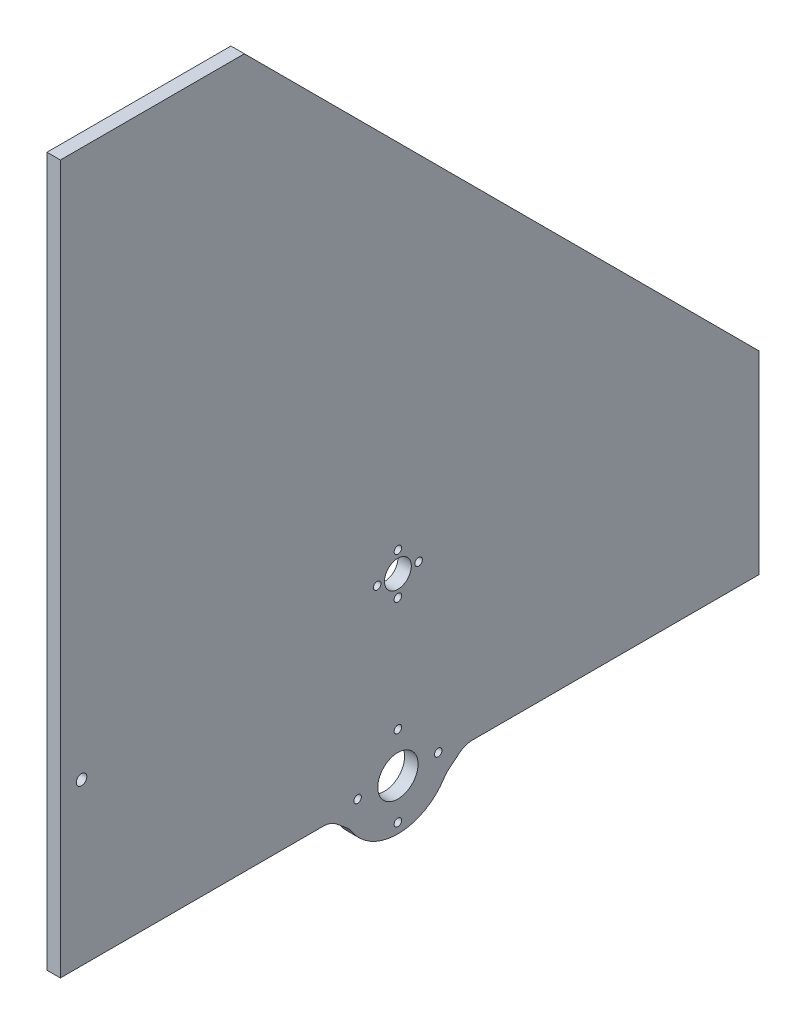
ISO-10303-21;
HEADER;
FILE_DESCRIPTION(('STEP AP214'),'2;1');
FILE_NAME('part.step','',(''),(''),'','','');
FILE_SCHEMA(('AUTOMOTIVE_DESIGN { 1 0 10303 214 1 1 1 1 }'));
ENDSEC;
DATA;
#1=APPLICATION_CONTEXT('core data for automotive mechanical design processes');
#2=APPLICATION_PROTOCOL_DEFINITION('international standard','automotive_design',2000,#1);
#3=PRODUCT_CONTEXT('',#1,'mechanical');
#4=PRODUCT('Part','Part','',(#3));
#5=PRODUCT_RELATED_PRODUCT_CATEGORY('part','',(#4));
#6=PRODUCT_DEFINITION_FORMATION('','',#4);
#7=PRODUCT_DEFINITION_CONTEXT('part definition',#1,'design');
#8=PRODUCT_DEFINITION('design','',#6,#7);
#9=PRODUCT_DEFINITION_SHAPE('','',#8);
#10=(LENGTH_UNIT() NAMED_UNIT(*) SI_UNIT(.MILLI.,.METRE.));
#11=(NAMED_UNIT(*) PLANE_ANGLE_UNIT() SI_UNIT($,.RADIAN.));
#12=(NAMED_UNIT(*) SI_UNIT($,.STERADIAN.) SOLID_ANGLE_UNIT());
#13=UNCERTAINTY_MEASURE_WITH_UNIT(LENGTH_MEASURE(1.E-05),#10,'distance_accuracy_value','');
#14=(GEOMETRIC_REPRESENTATION_CONTEXT(3) GLOBAL_UNCERTAINTY_ASSIGNED_CONTEXT((#13)) GLOBAL_UNIT_ASSIGNED_CONTEXT((#10,
#11,#12)) REPRESENTATION_CONTEXT('',''));
#15=CARTESIAN_POINT('',(0.,0.,0.));
#16=DIRECTION('',(0.,0.,1.));
#17=DIRECTION('',(1.,0.,0.));
#18=AXIS2_PLACEMENT_3D('',#15,#16,#17);
#19=CARTESIAN_POINT('',(6.35,0.,0.));
#20=DIRECTION('',(-1.,0.,0.));
#21=DIRECTION('',(0.,0.,1.));
#22=AXIS2_PLACEMENT_3D('',#19,#20,#21);
#23=PLANE('',#22);
#24=CARTESIAN_POINT('',(6.35,97.0026,-10.));
#25=DIRECTION('',(1.,0.,0.));
#26=DIRECTION('',(0.,0.,-1.));
#27=AXIS2_PLACEMENT_3D('',#24,#25,#26);
#28=CIRCLE('',#27,2.5);
#29=CARTESIAN_POINT('',(6.35,97.0026,-12.5));
#30=VERTEX_POINT('',#29);
#31=EDGE_CURVE('E486',#30,#30,#28,.T.);
#32=ORIENTED_EDGE('',*,*,#31,.F.);
#33=EDGE_LOOP('',(#32));
#34=FACE_BOUND('',#33,.T.);
#35=CARTESIAN_POINT('',(6.35,116.2812,-159.512));
#36=DIRECTION('',(1.,0.,0.));
#37=DIRECTION('',(0.,0.,-1.));
#38=AXIS2_PLACEMENT_3D('',#35,#36,#37);
#39=CIRCLE('',#38,1.778);
#40=CARTESIAN_POINT('',(6.35,116.2812,-161.29));
#41=VERTEX_POINT('',#40);
#42=EDGE_CURVE('E463',#41,#41,#39,.T.);
#43=ORIENTED_EDGE('',*,*,#42,.F.);
#44=EDGE_LOOP('',(#43));
#45=FACE_BOUND('',#44,.T.);
#46=CARTESIAN_POINT('',(6.35,106.5022,-149.733));
#47=DIRECTION('',(1.,0.,0.));
#48=DIRECTION('',(0.,0.,-1.));
#49=AXIS2_PLACEMENT_3D('',#46,#47,#48);
#50=CIRCLE('',#49,1.778);
#51=CARTESIAN_POINT('',(6.35,106.5022,-151.511));
#52=VERTEX_POINT('',#51);
#53=EDGE_CURVE('E454',#52,#52,#50,.T.);
#54=ORIENTED_EDGE('',*,*,#53,.F.);
#55=EDGE_LOOP('',(#54));
#56=FACE_BOUND('',#55,.T.);
#57=CARTESIAN_POINT('',(6.35,106.5022,-169.291));
#58=DIRECTION('',(1.,0.,0.));
#59=DIRECTION('',(0.,0.,-1.));
#60=AXIS2_PLACEMENT_3D('',#57,#58,#59);
#61=CIRCLE('',#60,1.778);
#62=CARTESIAN_POINT('',(6.35,106.5022,-171.069));
#63=VERTEX_POINT('',#62);
#64=EDGE_CURVE('E479',#63,#63,#61,.T.);
#65=ORIENTED_EDGE('',*,*,#64,.F.);
#66=EDGE_LOOP('',(#65));
#67=FACE_BOUND('',#66,.T.);
#68=CARTESIAN_POINT('',(6.35,96.7232,-159.512));
#69=DIRECTION('',(1.,0.,0.));
#70=DIRECTION('',(0.,0.,-1.));
#71=AXIS2_PLACEMENT_3D('',#68,#69,#70);
#72=CIRCLE('',#71,1.778);
#73=CARTESIAN_POINT('',(6.35,96.7232,-161.29));
#74=VERTEX_POINT('',#73);
#75=EDGE_CURVE('E470',#74,#74,#72,.T.);
#76=ORIENTED_EDGE('',*,*,#75,.F.);
#77=EDGE_LOOP('',(#76));
#78=FACE_BOUND('',#77,.T.);
#79=CARTESIAN_POINT('',(6.35,106.5022,-159.512));
#80=DIRECTION('',(1.,0.,0.));
#81=DIRECTION('',(0.,0.,-1.));
#82=AXIS2_PLACEMENT_3D('',#79,#80,#81);
#83=CIRCLE('',#82,6.34999999999999);
#84=CARTESIAN_POINT('',(6.35,106.5022,-165.862));
#85=VERTEX_POINT('',#84);
#86=EDGE_CURVE('E446',#85,#85,#83,.T.);
#87=ORIENTED_EDGE('',*,*,#86,.F.);
#88=EDGE_LOOP('',(#87));
#89=FACE_BOUND('',#88,.T.);
#90=CARTESIAN_POINT('',(6.35,23.8252,-140.462));
#91=DIRECTION('',(1.,0.,0.));
#92=DIRECTION('',(0.,0.,-1.));
#93=AXIS2_PLACEMENT_3D('',#90,#91,#92);
#94=CIRCLE('',#93,1.77800000000001);
#95=CARTESIAN_POINT('',(6.35,23.8252,-142.24));
#96=VERTEX_POINT('',#95);
#97=EDGE_CURVE('E430',#96,#96,#94,.T.);
#98=ORIENTED_EDGE('',*,*,#97,.F.);
#99=EDGE_LOOP('',(#98));
#100=FACE_BOUND('',#99,.T.);
#101=CARTESIAN_POINT('',(6.35,42.8752,-159.512));
#102=DIRECTION('',(1.,0.,0.));
#103=DIRECTION('',(0.,0.,-1.));
#104=AXIS2_PLACEMENT_3D('',#101,#102,#103);
#105=CIRCLE('',#104,1.77800000000001);
#106=CARTESIAN_POINT('',(6.35,42.8752,-161.29));
#107=VERTEX_POINT('',#106);
#108=EDGE_CURVE('E439',#107,#107,#105,.T.);
#109=ORIENTED_EDGE('',*,*,#108,.F.);
#110=EDGE_LOOP('',(#109));
#111=FACE_BOUND('',#110,.T.);
#112=CARTESIAN_POINT('',(6.35,23.8252,-159.512));
#113=DIRECTION('',(1.,0.,0.));
#114=DIRECTION('',(0.,0.,-1.));
#115=AXIS2_PLACEMENT_3D('',#112,#113,#114);
#116=CIRCLE('',#115,9.52500000000002);
#117=CARTESIAN_POINT('',(6.35,23.8252,-169.037));
#118=VERTEX_POINT('',#117);
#119=EDGE_CURVE('E407',#118,#118,#116,.T.);
#120=ORIENTED_EDGE('',*,*,#119,.F.);
#121=EDGE_LOOP('',(#120));
#122=FACE_BOUND('',#121,.T.);
#123=CARTESIAN_POINT('',(6.35,23.8252,-178.562));
#124=DIRECTION('',(1.,0.,0.));
#125=DIRECTION('',(0.,0.,-1.));
#126=AXIS2_PLACEMENT_3D('',#123,#124,#125);
#127=CIRCLE('',#126,1.77800000000001);
#128=CARTESIAN_POINT('',(6.35,23.8252,-180.34));
#129=VERTEX_POINT('',#128);
#130=EDGE_CURVE('E414',#129,#129,#127,.T.);
#131=ORIENTED_EDGE('',*,*,#130,.F.);
#132=EDGE_LOOP('',(#131));
#133=FACE_BOUND('',#132,.T.);
#134=CARTESIAN_POINT('',(6.35,4.77520000000007,-159.512));
#135=DIRECTION('',(1.,0.,0.));
#136=DIRECTION('',(0.,0.,-1.));
#137=AXIS2_PLACEMENT_3D('',#134,#135,#136);
#138=CIRCLE('',#137,1.77800000000001);
#139=CARTESIAN_POINT('',(6.35,4.77520000000007,-161.29));
#140=VERTEX_POINT('',#139);
#141=EDGE_CURVE('E423',#140,#140,#138,.T.);
#142=ORIENTED_EDGE('',*,*,#141,.F.);
#143=EDGE_LOOP('',(#142));
#144=FACE_BOUND('',#143,.T.);
#145=DIRECTION('',(0.,0.,-1.));
#146=VECTOR('',#145,1.);
#147=CARTESIAN_POINT('',(6.35,20.8026000000001,0.));
#148=LINE('',#147,#146);
#149=CARTESIAN_POINT('',(6.35,20.8026000000001,0.));
#150=VERTEX_POINT('',#149);
#151=CARTESIAN_POINT('',(6.35,20.8026,-124.18961565833));
#152=VERTEX_POINT('',#151);
#153=EDGE_CURVE('E313',#150,#152,#148,.T.);
#154=ORIENTED_EDGE('',*,*,#153,.T.);
#155=CARTESIAN_POINT('',(6.35,10.8026,-124.18961565833));
#156=DIRECTION('',(-1.,0.,0.));
#157=DIRECTION('',(0.,0.,1.));
#158=AXIS2_PLACEMENT_3D('',#155,#156,#157);
#159=CIRCLE('',#158,10.);
#160=CARTESIAN_POINT('',(6.35,18.5390682624872,-130.525786333394));
#161=VERTEX_POINT('',#160);
#162=EDGE_CURVE('E110',#152,#161,#159,.T.);
#163=ORIENTED_EDGE('',*,*,#162,.T.);
#164=DIRECTION('',(0.,-0.633617067506309,-0.773646826248713));
#165=VECTOR('',#164,1.);
#166=CARTESIAN_POINT('',(6.35,75.0793742249906,-61.4900382352941));
#167=LINE('',#166,#165);
#168=CARTESIAN_POINT('',(6.35,14.4799414737817,-135.481982620502));
#169=VERTEX_POINT('',#168);
#170=EDGE_CURVE('E258',#161,#169,#167,.T.);
#171=ORIENTED_EDGE('',*,*,#170,.T.);
#172=CARTESIAN_POINT('',(6.35,6.74347321129459,-129.145811945439));
#173=DIRECTION('',(-1.,0.,0.));
#174=DIRECTION('',(0.,0.,1.));
#175=AXIS2_PLACEMENT_3D('',#172,#173,#174);
#176=CIRCLE('',#175,10.);
#177=CARTESIAN_POINT('',(6.35,12.0805921788521,-137.602475656746));
#178=VERTEX_POINT('',#177);
#179=EDGE_CURVE('E305',#169,#178,#176,.T.);
#180=ORIENTED_EDGE('',*,*,#179,.T.);
#181=CARTESIAN_POINT('',(6.35,25.908,-159.512));
#182=DIRECTION('',(1.,0.,0.));
#183=DIRECTION('',(0.,0.,-1.));
#184=AXIS2_PLACEMENT_3D('',#181,#182,#183);
#185=CIRCLE('',#184,25.908);
#186=CARTESIAN_POINT('',(6.35,12.0805921788522,-181.421524343254));
#187=VERTEX_POINT('',#186);
#188=EDGE_CURVE('E217',#178,#187,#185,.T.);
#189=ORIENTED_EDGE('',*,*,#188,.T.);
#190=CARTESIAN_POINT('',(6.35,6.74347321129479,-189.878188054562));
#191=DIRECTION('',(-1.,0.,0.));
#192=DIRECTION('',(0.,0.,1.));
#193=AXIS2_PLACEMENT_3D('',#190,#191,#192);
#194=CIRCLE('',#193,10.);
#195=CARTESIAN_POINT('',(6.35,14.4799414737819,-183.542017379499));
#196=VERTEX_POINT('',#195);
#197=EDGE_CURVE('E296',#187,#196,#194,.T.);
#198=ORIENTED_EDGE('',*,*,#197,.T.);
#199=DIRECTION('',(0.,0.633617067506306,-0.773646826248715));
#200=VECTOR('',#199,1.);
#201=CARTESIAN_POINT('',(6.35,-81.304861308323,-66.5887147058818));
#202=LINE('',#201,#200);
#203=CARTESIAN_POINT('',(6.35,18.5390682624872,-188.498213666606));
#204=VERTEX_POINT('',#203);
#205=EDGE_CURVE('E250',#196,#204,#202,.T.);
#206=ORIENTED_EDGE('',*,*,#205,.T.);
#207=CARTESIAN_POINT('',(6.35,10.8026,-194.834384341669));
#208=DIRECTION('',(-1.,0.,0.));
#209=DIRECTION('',(0.,0.,1.));
#210=AXIS2_PLACEMENT_3D('',#207,#208,#209);
#211=CIRCLE('',#210,10.);
#212=CARTESIAN_POINT('',(6.35,20.8026,-194.834384341669));
#213=VERTEX_POINT('',#212);
#214=EDGE_CURVE('E293',#204,#213,#211,.T.);
#215=ORIENTED_EDGE('',*,*,#214,.T.);
#216=DIRECTION('',(0.,0.,-1.));
#217=VECTOR('',#216,1.);
#218=CARTESIAN_POINT('',(6.35,20.8026,0.));
#219=LINE('',#218,#217);
#220=CARTESIAN_POINT('',(6.35,20.8026,-330.2));
#221=VERTEX_POINT('',#220);
#222=EDGE_CURVE('E208',#213,#221,#219,.T.);
#223=ORIENTED_EDGE('',*,*,#222,.T.);
#224=DIRECTION('',(0.,1.,0.));
#225=VECTOR('',#224,1.);
#226=CARTESIAN_POINT('',(6.35,0.,-330.2));
#227=LINE('',#226,#225);
#228=CARTESIAN_POINT('',(6.35,112.361360549045,-330.2));
#229=VERTEX_POINT('',#228);
#230=EDGE_CURVE('E215',#221,#229,#227,.T.);
#231=ORIENTED_EDGE('',*,*,#230,.T.);
#232=DIRECTION('',(0.,0.707106781186546,0.707106781186549));
#233=VECTOR('',#232,1.);
#234=CARTESIAN_POINT('',(6.35,112.361360549045,-330.2));
#235=LINE('',#234,#233);
#236=CARTESIAN_POINT('',(6.35,355.6,-86.9613605490437));
#237=VERTEX_POINT('',#236);
#238=EDGE_CURVE('E341',#229,#237,#235,.T.);
#239=ORIENTED_EDGE('',*,*,#238,.T.);
#240=DIRECTION('',(0.,0.,1.));
#241=VECTOR('',#240,1.);
#242=CARTESIAN_POINT('',(6.35,355.6,0.));
#243=LINE('',#242,#241);
#244=CARTESIAN_POINT('',(6.35,355.6,0.));
#245=VERTEX_POINT('',#244);
#246=EDGE_CURVE('E243',#237,#245,#243,.T.);
#247=ORIENTED_EDGE('',*,*,#246,.T.);
#248=DIRECTION('',(0.,-1.,0.));
#249=VECTOR('',#248,1.);
#250=CARTESIAN_POINT('',(6.35,0.,0.));
#251=LINE('',#250,#249);
#252=EDGE_CURVE('E237',#245,#150,#251,.T.);
#253=ORIENTED_EDGE('',*,*,#252,.T.);
#254=EDGE_LOOP('',(#154,#163,#171,#180,#189,#198,#206,#215,#223,#231,#239,#247,#253));
#255=FACE_BOUND('',#254,.T.);
#256=ADVANCED_FACE('F101',(#34,#45,#56,#67,#78,#89,#100,#111,#122,#133,#144,#255),#23,.F.);
#257=CARTESIAN_POINT('',(0.,0.,0.));
#258=DIRECTION('',(-1.,0.,0.));
#259=DIRECTION('',(0.,0.,1.));
#260=AXIS2_PLACEMENT_3D('',#257,#258,#259);
#261=PLANE('',#260);
#262=CARTESIAN_POINT('',(0.,97.0026,-10.));
#263=DIRECTION('',(1.,0.,0.));
#264=DIRECTION('',(0.,0.,-1.));
#265=AXIS2_PLACEMENT_3D('',#262,#263,#264);
#266=CIRCLE('',#265,2.5);
#267=CARTESIAN_POINT('',(0.,97.0026,-12.5));
#268=VERTEX_POINT('',#267);
#269=EDGE_CURVE('E475',#268,#268,#266,.T.);
#270=ORIENTED_EDGE('',*,*,#269,.T.);
#271=EDGE_LOOP('',(#270));
#272=FACE_BOUND('',#271,.T.);
#273=CARTESIAN_POINT('',(0.,116.2812,-159.512));
#274=DIRECTION('',(1.,0.,0.));
#275=DIRECTION('',(0.,0.,-1.));
#276=AXIS2_PLACEMENT_3D('',#273,#274,#275);
#277=CIRCLE('',#276,1.778);
#278=CARTESIAN_POINT('',(0.,116.2812,-161.29));
#279=VERTEX_POINT('',#278);
#280=EDGE_CURVE('E450',#279,#279,#277,.T.);
#281=ORIENTED_EDGE('',*,*,#280,.T.);
#282=EDGE_LOOP('',(#281));
#283=FACE_BOUND('',#282,.T.);
#284=CARTESIAN_POINT('',(0.,106.5022,-149.733));
#285=DIRECTION('',(1.,0.,0.));
#286=DIRECTION('',(0.,0.,-1.));
#287=AXIS2_PLACEMENT_3D('',#284,#285,#286);
#288=CIRCLE('',#287,1.778);
#289=CARTESIAN_POINT('',(0.,106.5022,-151.511));
#290=VERTEX_POINT('',#289);
#291=EDGE_CURVE('E458',#290,#290,#288,.T.);
#292=ORIENTED_EDGE('',*,*,#291,.T.);
#293=EDGE_LOOP('',(#292));
#294=FACE_BOUND('',#293,.T.);
#295=CARTESIAN_POINT('',(0.,106.5022,-169.291));
#296=DIRECTION('',(1.,0.,0.));
#297=DIRECTION('',(0.,0.,-1.));
#298=AXIS2_PLACEMENT_3D('',#295,#296,#297);
#299=CIRCLE('',#298,1.778);
#300=CARTESIAN_POINT('',(0.,106.5022,-171.069));
#301=VERTEX_POINT('',#300);
#302=EDGE_CURVE('E459',#301,#301,#299,.T.);
#303=ORIENTED_EDGE('',*,*,#302,.T.);
#304=EDGE_LOOP('',(#303));
#305=FACE_BOUND('',#304,.T.);
#306=CARTESIAN_POINT('',(0.,96.7232,-159.512));
#307=DIRECTION('',(1.,0.,0.));
#308=DIRECTION('',(0.,0.,-1.));
#309=AXIS2_PLACEMENT_3D('',#306,#307,#308);
#310=CIRCLE('',#309,1.778);
#311=CARTESIAN_POINT('',(0.,96.7232,-161.29));
#312=VERTEX_POINT('',#311);
#313=EDGE_CURVE('E474',#312,#312,#310,.T.);
#314=ORIENTED_EDGE('',*,*,#313,.T.);
#315=EDGE_LOOP('',(#314));
#316=FACE_BOUND('',#315,.T.);
#317=CARTESIAN_POINT('',(0.,106.5022,-159.512));
#318=DIRECTION('',(1.,0.,0.));
#319=DIRECTION('',(0.,0.,-1.));
#320=AXIS2_PLACEMENT_3D('',#317,#318,#319);
#321=CIRCLE('',#320,6.34999999999999);
#322=CARTESIAN_POINT('',(0.,106.5022,-165.862));
#323=VERTEX_POINT('',#322);
#324=EDGE_CURVE('E435',#323,#323,#321,.T.);
#325=ORIENTED_EDGE('',*,*,#324,.T.);
#326=EDGE_LOOP('',(#325));
#327=FACE_BOUND('',#326,.T.);
#328=CARTESIAN_POINT('',(0.,23.8252,-140.462));
#329=DIRECTION('',(1.,0.,0.));
#330=DIRECTION('',(0.,0.,-1.));
#331=AXIS2_PLACEMENT_3D('',#328,#329,#330);
#332=CIRCLE('',#331,1.77800000000001);
#333=CARTESIAN_POINT('',(0.,23.8252,-142.24));
#334=VERTEX_POINT('',#333);
#335=EDGE_CURVE('E434',#334,#334,#332,.T.);
#336=ORIENTED_EDGE('',*,*,#335,.T.);
#337=EDGE_LOOP('',(#336));
#338=FACE_BOUND('',#337,.T.);
#339=CARTESIAN_POINT('',(0.,42.8752,-159.512));
#340=DIRECTION('',(1.,0.,0.));
#341=DIRECTION('',(0.,0.,-1.));
#342=AXIS2_PLACEMENT_3D('',#339,#340,#341);
#343=CIRCLE('',#342,1.77800000000001);
#344=CARTESIAN_POINT('',(0.,42.8752,-161.29));
#345=VERTEX_POINT('',#344);
#346=EDGE_CURVE('E419',#345,#345,#343,.T.);
#347=ORIENTED_EDGE('',*,*,#346,.T.);
#348=EDGE_LOOP('',(#347));
#349=FACE_BOUND('',#348,.T.);
#350=CARTESIAN_POINT('',(0.,23.8252,-159.512));
#351=DIRECTION('',(1.,0.,0.));
#352=DIRECTION('',(0.,0.,-1.));
#353=AXIS2_PLACEMENT_3D('',#350,#351,#352);
#354=CIRCLE('',#353,9.52500000000002);
#355=CARTESIAN_POINT('',(0.,23.8252,-169.037));
#356=VERTEX_POINT('',#355);
#357=EDGE_CURVE('E403',#356,#356,#354,.T.);
#358=ORIENTED_EDGE('',*,*,#357,.T.);
#359=EDGE_LOOP('',(#358));
#360=FACE_BOUND('',#359,.T.);
#361=CARTESIAN_POINT('',(0.,4.77520000000007,-159.512));
#362=DIRECTION('',(1.,0.,0.));
#363=DIRECTION('',(0.,0.,-1.));
#364=AXIS2_PLACEMENT_3D('',#361,#362,#363);
#365=CIRCLE('',#364,1.77800000000001);
#366=CARTESIAN_POINT('',(0.,4.77520000000007,-161.29));
#367=VERTEX_POINT('',#366);
#368=EDGE_CURVE('E412',#367,#367,#365,.T.);
#369=ORIENTED_EDGE('',*,*,#368,.T.);
#370=EDGE_LOOP('',(#369));
#371=FACE_BOUND('',#370,.T.);
#372=CARTESIAN_POINT('',(0.,23.8252,-178.562));
#373=DIRECTION('',(1.,0.,0.));
#374=DIRECTION('',(0.,0.,-1.));
#375=AXIS2_PLACEMENT_3D('',#372,#373,#374);
#376=CIRCLE('',#375,1.77800000000001);
#377=CARTESIAN_POINT('',(0.,23.8252,-180.34));
#378=VERTEX_POINT('',#377);
#379=EDGE_CURVE('E418',#378,#378,#376,.T.);
#380=ORIENTED_EDGE('',*,*,#379,.T.);
#381=EDGE_LOOP('',(#380));
#382=FACE_BOUND('',#381,.T.);
#383=DIRECTION('',(0.,0.,-1.));
#384=VECTOR('',#383,1.);
#385=CARTESIAN_POINT('',(0.,20.8026,0.));
#386=LINE('',#385,#384);
#387=CARTESIAN_POINT('',(0.,20.8026,-194.834384341669));
#388=VERTEX_POINT('',#387);
#389=CARTESIAN_POINT('',(0.,20.8026,-330.2));
#390=VERTEX_POINT('',#389);
#391=EDGE_CURVE('E198',#388,#390,#386,.T.);
#392=ORIENTED_EDGE('',*,*,#391,.F.);
#393=CARTESIAN_POINT('',(0.,10.8026,-194.834384341669));
#394=DIRECTION('',(-1.,0.,0.));
#395=DIRECTION('',(0.,0.,1.));
#396=AXIS2_PLACEMENT_3D('',#393,#394,#395);
#397=CIRCLE('',#396,10.);
#398=CARTESIAN_POINT('',(0.,18.5390682624872,-188.498213666606));
#399=VERTEX_POINT('',#398);
#400=EDGE_CURVE('E290',#388,#399,#397,.F.);
#401=ORIENTED_EDGE('',*,*,#400,.T.);
#402=DIRECTION('',(0.,-0.633617067506306,0.773646826248715));
#403=VECTOR('',#402,1.);
#404=CARTESIAN_POINT('',(0.,13.3659537180332,-182.181837649639));
#405=LINE('',#404,#403);
#406=CARTESIAN_POINT('',(0.,14.4799414737819,-183.542017379499));
#407=VERTEX_POINT('',#406);
#408=EDGE_CURVE('E254',#399,#407,#405,.T.);
#409=ORIENTED_EDGE('',*,*,#408,.T.);
#410=CARTESIAN_POINT('',(0.,6.74347321129479,-189.878188054562));
#411=DIRECTION('',(-1.,0.,0.));
#412=DIRECTION('',(0.,0.,1.));
#413=AXIS2_PLACEMENT_3D('',#410,#411,#412);
#414=CIRCLE('',#413,10.);
#415=CARTESIAN_POINT('',(0.,12.0805921788522,-181.421524343254));
#416=VERTEX_POINT('',#415);
#417=EDGE_CURVE('E299',#407,#416,#414,.F.);
#418=ORIENTED_EDGE('',*,*,#417,.T.);
#419=CARTESIAN_POINT('',(0.,25.908,-159.512));
#420=DIRECTION('',(1.,0.,0.));
#421=DIRECTION('',(0.,0.,-1.));
#422=AXIS2_PLACEMENT_3D('',#419,#420,#421);
#423=CIRCLE('',#422,25.908);
#424=CARTESIAN_POINT('',(0.,12.0805921788521,-137.602475656746));
#425=VERTEX_POINT('',#424);
#426=EDGE_CURVE('E324',#425,#416,#423,.T.);
#427=ORIENTED_EDGE('',*,*,#426,.F.);
#428=CARTESIAN_POINT('',(0.,6.74347321129459,-129.145811945439));
#429=DIRECTION('',(-1.,0.,0.));
#430=DIRECTION('',(0.,0.,1.));
#431=AXIS2_PLACEMENT_3D('',#428,#429,#430);
#432=CIRCLE('',#431,10.);
#433=CARTESIAN_POINT('',(0.,14.4799414737817,-135.481982620502));
#434=VERTEX_POINT('',#433);
#435=EDGE_CURVE('E302',#425,#434,#432,.F.);
#436=ORIENTED_EDGE('',*,*,#435,.T.);
#437=DIRECTION('',(0.,0.633617067506309,0.773646826248713));
#438=VECTOR('',#437,1.);
#439=CARTESIAN_POINT('',(0.,20.8026,-127.762012700003));
#440=LINE('',#439,#438);
#441=CARTESIAN_POINT('',(0.,18.5390682624872,-130.525786333393));
#442=VERTEX_POINT('',#441);
#443=EDGE_CURVE('E262',#434,#442,#440,.T.);
#444=ORIENTED_EDGE('',*,*,#443,.T.);
#445=CARTESIAN_POINT('',(0.,10.8026,-124.18961565833));
#446=DIRECTION('',(-1.,0.,0.));
#447=DIRECTION('',(0.,0.,1.));
#448=AXIS2_PLACEMENT_3D('',#445,#446,#447);
#449=CIRCLE('',#448,10.);
#450=CARTESIAN_POINT('',(0.,20.8026,-124.18961565833));
#451=VERTEX_POINT('',#450);
#452=EDGE_CURVE('E12',#442,#451,#449,.F.);
#453=ORIENTED_EDGE('',*,*,#452,.T.);
#454=DIRECTION('',(0.,0.,-1.));
#455=VECTOR('',#454,1.);
#456=CARTESIAN_POINT('',(0.,20.8026000000001,0.));
#457=LINE('',#456,#455);
#458=CARTESIAN_POINT('',(0.,20.8026000000001,0.));
#459=VERTEX_POINT('',#458);
#460=EDGE_CURVE('E321',#459,#451,#457,.T.);
#461=ORIENTED_EDGE('',*,*,#460,.F.);
#462=DIRECTION('',(0.,-1.,0.));
#463=VECTOR('',#462,1.);
#464=CARTESIAN_POINT('',(0.,0.,0.));
#465=LINE('',#464,#463);
#466=CARTESIAN_POINT('',(0.,355.6,0.));
#467=VERTEX_POINT('',#466);
#468=EDGE_CURVE('E224',#467,#459,#465,.T.);
#469=ORIENTED_EDGE('',*,*,#468,.F.);
#470=DIRECTION('',(0.,0.,1.));
#471=VECTOR('',#470,1.);
#472=CARTESIAN_POINT('',(0.,355.6,0.));
#473=LINE('',#472,#471);
#474=CARTESIAN_POINT('',(0.,355.6,-86.9613605490437));
#475=VERTEX_POINT('',#474);
#476=EDGE_CURVE('E228',#475,#467,#473,.T.);
#477=ORIENTED_EDGE('',*,*,#476,.F.);
#478=DIRECTION('',(0.,0.707106781186546,0.707106781186549));
#479=VECTOR('',#478,1.);
#480=CARTESIAN_POINT('',(0.,112.361360549045,-330.2));
#481=LINE('',#480,#479);
#482=CARTESIAN_POINT('',(0.,112.361360549045,-330.2));
#483=VERTEX_POINT('',#482);
#484=EDGE_CURVE('E222',#483,#475,#481,.T.);
#485=ORIENTED_EDGE('',*,*,#484,.F.);
#486=DIRECTION('',(0.,1.,0.));
#487=VECTOR('',#486,1.);
#488=CARTESIAN_POINT('',(0.,0.,-330.2));
#489=LINE('',#488,#487);
#490=EDGE_CURVE('E213',#390,#483,#489,.T.);
#491=ORIENTED_EDGE('',*,*,#490,.F.);
#492=EDGE_LOOP('',(#392,#401,#409,#418,#427,#436,#444,#453,#461,#469,#477,#485,#491));
#493=FACE_BOUND('',#492,.T.);
#494=ADVANCED_FACE('F220',(#272,#283,#294,#305,#316,#327,#338,#349,#360,#371,#382,#493),#261,.T.);
#495=CARTESIAN_POINT('',(6.35,0.,-330.2));
#496=DIRECTION('',(0.,0.,1.));
#497=DIRECTION('',(1.,0.,0.));
#498=AXIS2_PLACEMENT_3D('',#495,#496,#497);
#499=PLANE('',#498);
#500=DIRECTION('',(1.,0.,0.));
#501=VECTOR('',#500,1.);
#502=CARTESIAN_POINT('',(0.,20.8026,-330.2));
#503=LINE('',#502,#501);
#504=EDGE_CURVE('E202',#390,#221,#503,.T.);
#505=ORIENTED_EDGE('',*,*,#504,.F.);
#506=ORIENTED_EDGE('',*,*,#490,.T.);
#507=DIRECTION('',(-1.,0.,0.));
#508=VECTOR('',#507,1.);
#509=CARTESIAN_POINT('',(6.35,112.361360549045,-330.2));
#510=LINE('',#509,#508);
#511=EDGE_CURVE('E247',#229,#483,#510,.T.);
#512=ORIENTED_EDGE('',*,*,#511,.F.);
#513=ORIENTED_EDGE('',*,*,#230,.F.);
#514=EDGE_LOOP('',(#505,#506,#512,#513));
#515=FACE_BOUND('',#514,.T.);
#516=ADVANCED_FACE('F211',(#515),#499,.F.);
#517=CARTESIAN_POINT('',(6.35,0.,0.));
#518=DIRECTION('',(0.,0.,-1.));
#519=DIRECTION('',(-1.,0.,0.));
#520=AXIS2_PLACEMENT_3D('',#517,#518,#519);
#521=PLANE('',#520);
#522=DIRECTION('',(1.,0.,0.));
#523=VECTOR('',#522,1.);
#524=CARTESIAN_POINT('',(0.,20.8026000000001,0.));
#525=LINE('',#524,#523);
#526=EDGE_CURVE('E231',#459,#150,#525,.T.);
#527=ORIENTED_EDGE('',*,*,#526,.T.);
#528=ORIENTED_EDGE('',*,*,#252,.F.);
#529=DIRECTION('',(-1.,0.,0.));
#530=VECTOR('',#529,1.);
#531=CARTESIAN_POINT('',(6.35,355.6,0.));
#532=LINE('',#531,#530);
#533=EDGE_CURVE('E238',#245,#467,#532,.T.);
#534=ORIENTED_EDGE('',*,*,#533,.T.);
#535=ORIENTED_EDGE('',*,*,#468,.T.);
#536=EDGE_LOOP('',(#527,#528,#534,#535));
#537=FACE_BOUND('',#536,.T.);
#538=ADVANCED_FACE('F352',(#537),#521,.F.);
#539=CARTESIAN_POINT('',(6.35,112.361360549045,-330.2));
#540=DIRECTION('',(0.,-0.707106781186549,0.707106781186546));
#541=DIRECTION('',(0.,-0.707106781186546,-0.707106781186549));
#542=AXIS2_PLACEMENT_3D('',#539,#540,#541);
#543=PLANE('',#542);
#544=ORIENTED_EDGE('',*,*,#484,.T.);
#545=DIRECTION('',(-1.,0.,0.));
#546=VECTOR('',#545,1.);
#547=CARTESIAN_POINT('',(6.35,355.6,-86.9613605490437));
#548=LINE('',#547,#546);
#549=EDGE_CURVE('E242',#237,#475,#548,.T.);
#550=ORIENTED_EDGE('',*,*,#549,.F.);
#551=ORIENTED_EDGE('',*,*,#238,.F.);
#552=ORIENTED_EDGE('',*,*,#511,.T.);
#553=EDGE_LOOP('',(#544,#550,#551,#552));
#554=FACE_BOUND('',#553,.T.);
#555=ADVANCED_FACE('F354',(#554),#543,.F.);
#556=CARTESIAN_POINT('',(6.35,355.6,0.));
#557=DIRECTION('',(0.,-1.,0.));
#558=DIRECTION('',(0.,0.,-1.));
#559=AXIS2_PLACEMENT_3D('',#556,#557,#558);
#560=PLANE('',#559);
#561=ORIENTED_EDGE('',*,*,#476,.T.);
#562=ORIENTED_EDGE('',*,*,#533,.F.);
#563=ORIENTED_EDGE('',*,*,#246,.F.);
#564=ORIENTED_EDGE('',*,*,#549,.T.);
#565=EDGE_LOOP('',(#561,#562,#563,#564));
#566=FACE_BOUND('',#565,.T.);
#567=ADVANCED_FACE('F350',(#566),#560,.F.);
#568=CARTESIAN_POINT('',(0.,25.908,-159.512));
#569=DIRECTION('',(1.,0.,0.));
#570=DIRECTION('',(0.,0.,-1.));
#571=AXIS2_PLACEMENT_3D('',#568,#569,#570);
#572=CYLINDRICAL_SURFACE('',#571,25.908);
#573=ORIENTED_EDGE('',*,*,#426,.T.);
#574=DIRECTION('',(1.,0.,0.));
#575=VECTOR('',#574,1.);
#576=CARTESIAN_POINT('',(0.,12.0805921788522,-181.421524343254));
#577=LINE('',#576,#575);
#578=EDGE_CURVE('E277',#416,#187,#577,.T.);
#579=ORIENTED_EDGE('',*,*,#578,.T.);
#580=ORIENTED_EDGE('',*,*,#188,.F.);
#581=DIRECTION('',(1.,0.,0.));
#582=VECTOR('',#581,1.);
#583=CARTESIAN_POINT('',(0.,12.0805921788521,-137.602475656746));
#584=LINE('',#583,#582);
#585=EDGE_CURVE('E273',#178,#425,#584,.F.);
#586=ORIENTED_EDGE('',*,*,#585,.T.);
#587=EDGE_LOOP('',(#573,#579,#580,#586));
#588=FACE_BOUND('',#587,.T.);
#589=ADVANCED_FACE('F375',(#588),#572,.T.);
#590=CARTESIAN_POINT('',(0.,20.8026000000001,0.));
#591=DIRECTION('',(0.,-1.,0.));
#592=DIRECTION('',(0.,0.,-1.));
#593=AXIS2_PLACEMENT_3D('',#590,#591,#592);
#594=PLANE('',#593);
#595=ORIENTED_EDGE('',*,*,#460,.T.);
#596=DIRECTION('',(1.,0.,0.));
#597=VECTOR('',#596,1.);
#598=CARTESIAN_POINT('',(0.,20.8026,-124.18961565833));
#599=LINE('',#598,#597);
#600=EDGE_CURVE('E287',#451,#152,#599,.T.);
#601=ORIENTED_EDGE('',*,*,#600,.T.);
#602=ORIENTED_EDGE('',*,*,#153,.F.);
#603=ORIENTED_EDGE('',*,*,#526,.F.);
#604=EDGE_LOOP('',(#595,#601,#602,#603));
#605=FACE_BOUND('',#604,.T.);
#606=ADVANCED_FACE('F319',(#605),#594,.T.);
#607=CARTESIAN_POINT('',(0.,20.8026,0.));
#608=DIRECTION('',(0.,-1.,0.));
#609=DIRECTION('',(0.,0.,-1.));
#610=AXIS2_PLACEMENT_3D('',#607,#608,#609);
#611=PLANE('',#610);
#612=ORIENTED_EDGE('',*,*,#222,.F.);
#613=DIRECTION('',(-1.,0.,0.));
#614=VECTOR('',#613,1.);
#615=CARTESIAN_POINT('',(0.,20.8026,-194.834384341669));
#616=LINE('',#615,#614);
#617=EDGE_CURVE('E205',#213,#388,#616,.T.);
#618=ORIENTED_EDGE('',*,*,#617,.T.);
#619=ORIENTED_EDGE('',*,*,#391,.T.);
#620=ORIENTED_EDGE('',*,*,#504,.T.);
#621=EDGE_LOOP('',(#612,#618,#619,#620));
#622=FACE_BOUND('',#621,.T.);
#623=ADVANCED_FACE('F201',(#622),#611,.T.);
#624=CARTESIAN_POINT('',(0.,23.8252,-178.562));
#625=DIRECTION('',(1.,0.,0.));
#626=DIRECTION('',(0.,0.,-1.));
#627=AXIS2_PLACEMENT_3D('',#624,#625,#626);
#628=CYLINDRICAL_SURFACE('',#627,1.77800000000001);
#629=ORIENTED_EDGE('',*,*,#379,.F.);
#630=EDGE_LOOP('',(#629));
#631=FACE_BOUND('',#630,.T.);
#632=ORIENTED_EDGE('',*,*,#130,.T.);
#633=EDGE_LOOP('',(#632));
#634=FACE_BOUND('',#633,.T.);
#635=ADVANCED_FACE('F536',(#631,#634),#628,.F.);
#636=CARTESIAN_POINT('',(0.,4.77520000000007,-159.512));
#637=DIRECTION('',(1.,0.,0.));
#638=DIRECTION('',(0.,0.,-1.));
#639=AXIS2_PLACEMENT_3D('',#636,#637,#638);
#640=CYLINDRICAL_SURFACE('',#639,1.77800000000001);
#641=ORIENTED_EDGE('',*,*,#368,.F.);
#642=EDGE_LOOP('',(#641));
#643=FACE_BOUND('',#642,.T.);
#644=ORIENTED_EDGE('',*,*,#141,.T.);
#645=EDGE_LOOP('',(#644));
#646=FACE_BOUND('',#645,.T.);
#647=ADVANCED_FACE('F533',(#643,#646),#640,.F.);
#648=CARTESIAN_POINT('',(0.,23.8252,-159.512));
#649=DIRECTION('',(1.,0.,0.));
#650=DIRECTION('',(0.,0.,-1.));
#651=AXIS2_PLACEMENT_3D('',#648,#649,#650);
#652=CYLINDRICAL_SURFACE('',#651,9.52500000000002);
#653=ORIENTED_EDGE('',*,*,#357,.F.);
#654=EDGE_LOOP('',(#653));
#655=FACE_BOUND('',#654,.T.);
#656=ORIENTED_EDGE('',*,*,#119,.T.);
#657=EDGE_LOOP('',(#656));
#658=FACE_BOUND('',#657,.T.);
#659=ADVANCED_FACE('F528',(#655,#658),#652,.F.);
#660=CARTESIAN_POINT('',(0.,42.8752,-159.512));
#661=DIRECTION('',(1.,0.,0.));
#662=DIRECTION('',(0.,0.,-1.));
#663=AXIS2_PLACEMENT_3D('',#660,#661,#662);
#664=CYLINDRICAL_SURFACE('',#663,1.77800000000001);
#665=ORIENTED_EDGE('',*,*,#346,.F.);
#666=EDGE_LOOP('',(#665));
#667=FACE_BOUND('',#666,.T.);
#668=ORIENTED_EDGE('',*,*,#108,.T.);
#669=EDGE_LOOP('',(#668));
#670=FACE_BOUND('',#669,.T.);
#671=ADVANCED_FACE('F525',(#667,#670),#664,.F.);
#672=CARTESIAN_POINT('',(0.,23.8252,-140.462));
#673=DIRECTION('',(1.,0.,0.));
#674=DIRECTION('',(0.,0.,-1.));
#675=AXIS2_PLACEMENT_3D('',#672,#673,#674);
#676=CYLINDRICAL_SURFACE('',#675,1.77800000000001);
#677=ORIENTED_EDGE('',*,*,#335,.F.);
#678=EDGE_LOOP('',(#677));
#679=FACE_BOUND('',#678,.T.);
#680=ORIENTED_EDGE('',*,*,#97,.T.);
#681=EDGE_LOOP('',(#680));
#682=FACE_BOUND('',#681,.T.);
#683=ADVANCED_FACE('F523',(#679,#682),#676,.F.);
#684=CARTESIAN_POINT('',(0.,106.5022,-159.512));
#685=DIRECTION('',(1.,0.,0.));
#686=DIRECTION('',(0.,0.,-1.));
#687=AXIS2_PLACEMENT_3D('',#684,#685,#686);
#688=CYLINDRICAL_SURFACE('',#687,6.34999999999999);
#689=ORIENTED_EDGE('',*,*,#324,.F.);
#690=EDGE_LOOP('',(#689));
#691=FACE_BOUND('',#690,.T.);
#692=ORIENTED_EDGE('',*,*,#86,.T.);
#693=EDGE_LOOP('',(#692));
#694=FACE_BOUND('',#693,.T.);
#695=ADVANCED_FACE('F512',(#691,#694),#688,.F.);
#696=CARTESIAN_POINT('',(0.,96.7232,-159.512));
#697=DIRECTION('',(1.,0.,0.));
#698=DIRECTION('',(0.,0.,-1.));
#699=AXIS2_PLACEMENT_3D('',#696,#697,#698);
#700=CYLINDRICAL_SURFACE('',#699,1.778);
#701=ORIENTED_EDGE('',*,*,#313,.F.);
#702=EDGE_LOOP('',(#701));
#703=FACE_BOUND('',#702,.T.);
#704=ORIENTED_EDGE('',*,*,#75,.T.);
#705=EDGE_LOOP('',(#704));
#706=FACE_BOUND('',#705,.T.);
#707=ADVANCED_FACE('F508',(#703,#706),#700,.F.);
#708=CARTESIAN_POINT('',(0.,106.5022,-169.291));
#709=DIRECTION('',(1.,0.,0.));
#710=DIRECTION('',(0.,0.,-1.));
#711=AXIS2_PLACEMENT_3D('',#708,#709,#710);
#712=CYLINDRICAL_SURFACE('',#711,1.778);
#713=ORIENTED_EDGE('',*,*,#302,.F.);
#714=EDGE_LOOP('',(#713));
#715=FACE_BOUND('',#714,.T.);
#716=ORIENTED_EDGE('',*,*,#64,.T.);
#717=EDGE_LOOP('',(#716));
#718=FACE_BOUND('',#717,.T.);
#719=ADVANCED_FACE('F504',(#715,#718),#712,.F.);
#720=CARTESIAN_POINT('',(0.,106.5022,-149.733));
#721=DIRECTION('',(1.,0.,0.));
#722=DIRECTION('',(0.,0.,-1.));
#723=AXIS2_PLACEMENT_3D('',#720,#721,#722);
#724=CYLINDRICAL_SURFACE('',#723,1.778);
#725=ORIENTED_EDGE('',*,*,#291,.F.);
#726=EDGE_LOOP('',(#725));
#727=FACE_BOUND('',#726,.T.);
#728=ORIENTED_EDGE('',*,*,#53,.T.);
#729=EDGE_LOOP('',(#728));
#730=FACE_BOUND('',#729,.T.);
#731=ADVANCED_FACE('F507',(#727,#730),#724,.F.);
#732=CARTESIAN_POINT('',(0.,116.2812,-159.512));
#733=DIRECTION('',(1.,0.,0.));
#734=DIRECTION('',(0.,0.,-1.));
#735=AXIS2_PLACEMENT_3D('',#732,#733,#734);
#736=CYLINDRICAL_SURFACE('',#735,1.778);
#737=ORIENTED_EDGE('',*,*,#280,.F.);
#738=EDGE_LOOP('',(#737));
#739=FACE_BOUND('',#738,.T.);
#740=ORIENTED_EDGE('',*,*,#42,.T.);
#741=EDGE_LOOP('',(#740));
#742=FACE_BOUND('',#741,.T.);
#743=ADVANCED_FACE('F514',(#739,#742),#736,.F.);
#744=CARTESIAN_POINT('',(0.,13.3659537180332,-182.181837649639));
#745=DIRECTION('',(0.,0.773646826248715,0.633617067506306));
#746=DIRECTION('',(1.,0.,0.));
#747=AXIS2_PLACEMENT_3D('',#744,#745,#746);
#748=PLANE('',#747);
#749=ORIENTED_EDGE('',*,*,#408,.F.);
#750=DIRECTION('',(-1.,0.,0.));
#751=VECTOR('',#750,1.);
#752=CARTESIAN_POINT('',(0.,18.5390682624872,-188.498213666606));
#753=LINE('',#752,#751);
#754=EDGE_CURVE('E270',#399,#204,#753,.F.);
#755=ORIENTED_EDGE('',*,*,#754,.T.);
#756=ORIENTED_EDGE('',*,*,#205,.F.);
#757=DIRECTION('',(1.,0.,0.));
#758=VECTOR('',#757,1.);
#759=CARTESIAN_POINT('',(0.,14.4799414737819,-183.542017379499));
#760=LINE('',#759,#758);
#761=EDGE_CURVE('E267',#196,#407,#760,.F.);
#762=ORIENTED_EDGE('',*,*,#761,.T.);
#763=EDGE_LOOP('',(#749,#755,#756,#762));
#764=FACE_BOUND('',#763,.T.);
#765=ADVANCED_FACE('F398',(#764),#748,.F.);
#766=CARTESIAN_POINT('',(0.,20.8026,-127.762012700003));
#767=DIRECTION('',(0.,0.773646826248713,-0.633617067506308));
#768=DIRECTION('',(1.,0.,0.));
#769=AXIS2_PLACEMENT_3D('',#766,#767,#768);
#770=PLANE('',#769);
#771=ORIENTED_EDGE('',*,*,#443,.F.);
#772=DIRECTION('',(1.,0.,0.));
#773=VECTOR('',#772,1.);
#774=CARTESIAN_POINT('',(0.,14.4799414737817,-135.481982620502));
#775=LINE('',#774,#773);
#776=EDGE_CURVE('E284',#434,#169,#775,.T.);
#777=ORIENTED_EDGE('',*,*,#776,.T.);
#778=ORIENTED_EDGE('',*,*,#170,.F.);
#779=DIRECTION('',(1.,0.,0.));
#780=VECTOR('',#779,1.);
#781=CARTESIAN_POINT('',(0.,18.5390682624872,-130.525786333393));
#782=LINE('',#781,#780);
#783=EDGE_CURVE('E281',#161,#442,#782,.F.);
#784=ORIENTED_EDGE('',*,*,#783,.T.);
#785=EDGE_LOOP('',(#771,#777,#778,#784));
#786=FACE_BOUND('',#785,.T.);
#787=ADVANCED_FACE('F316',(#786),#770,.F.);
#788=CARTESIAN_POINT('',(0.,10.8026,-194.834384341669));
#789=DIRECTION('',(-1.,0.,0.));
#790=DIRECTION('',(0.,0.,1.));
#791=AXIS2_PLACEMENT_3D('',#788,#789,#790);
#792=CYLINDRICAL_SURFACE('',#791,10.);
#793=ORIENTED_EDGE('',*,*,#214,.F.);
#794=ORIENTED_EDGE('',*,*,#754,.F.);
#795=ORIENTED_EDGE('',*,*,#400,.F.);
#796=ORIENTED_EDGE('',*,*,#617,.F.);
#797=EDGE_LOOP('',(#793,#794,#795,#796));
#798=FACE_BOUND('',#797,.T.);
#799=ADVANCED_FACE('F401',(#798),#792,.F.);
#800=CARTESIAN_POINT('',(0.,6.74347321129479,-189.878188054562));
#801=DIRECTION('',(1.,0.,0.));
#802=DIRECTION('',(0.,0.,-1.));
#803=AXIS2_PLACEMENT_3D('',#800,#801,#802);
#804=CYLINDRICAL_SURFACE('',#803,10.);
#805=ORIENTED_EDGE('',*,*,#417,.F.);
#806=ORIENTED_EDGE('',*,*,#761,.F.);
#807=ORIENTED_EDGE('',*,*,#197,.F.);
#808=ORIENTED_EDGE('',*,*,#578,.F.);
#809=EDGE_LOOP('',(#805,#806,#807,#808));
#810=FACE_BOUND('',#809,.T.);
#811=ADVANCED_FACE('F392',(#810),#804,.F.);
#812=CARTESIAN_POINT('',(0.,6.74347321129459,-129.145811945439));
#813=DIRECTION('',(1.,0.,0.));
#814=DIRECTION('',(0.,0.,-1.));
#815=AXIS2_PLACEMENT_3D('',#812,#813,#814);
#816=CYLINDRICAL_SURFACE('',#815,10.);
#817=ORIENTED_EDGE('',*,*,#179,.F.);
#818=ORIENTED_EDGE('',*,*,#776,.F.);
#819=ORIENTED_EDGE('',*,*,#435,.F.);
#820=ORIENTED_EDGE('',*,*,#585,.F.);
#821=EDGE_LOOP('',(#817,#818,#819,#820));
#822=FACE_BOUND('',#821,.T.);
#823=ADVANCED_FACE('F502',(#822),#816,.F.);
#824=CARTESIAN_POINT('',(0.,10.8026,-124.18961565833));
#825=DIRECTION('',(1.,0.,0.));
#826=DIRECTION('',(0.,0.,-1.));
#827=AXIS2_PLACEMENT_3D('',#824,#825,#826);
#828=CYLINDRICAL_SURFACE('',#827,10.);
#829=ORIENTED_EDGE('',*,*,#452,.F.);
#830=ORIENTED_EDGE('',*,*,#783,.F.);
#831=ORIENTED_EDGE('',*,*,#162,.F.);
#832=ORIENTED_EDGE('',*,*,#600,.F.);
#833=EDGE_LOOP('',(#829,#830,#831,#832));
#834=FACE_BOUND('',#833,.T.);
#835=ADVANCED_FACE('F103',(#834),#828,.F.);
#836=CARTESIAN_POINT('',(0.,97.0026,-10.));
#837=DIRECTION('',(1.,0.,0.));
#838=DIRECTION('',(0.,0.,-1.));
#839=AXIS2_PLACEMENT_3D('',#836,#837,#838);
#840=CYLINDRICAL_SURFACE('',#839,2.5);
#841=ORIENTED_EDGE('',*,*,#269,.F.);
#842=EDGE_LOOP('',(#841));
#843=FACE_BOUND('',#842,.T.);
#844=ORIENTED_EDGE('',*,*,#31,.T.);
#845=EDGE_LOOP('',(#844));
#846=FACE_BOUND('',#845,.T.);
#847=ADVANCED_FACE('F495',(#843,#846),#840,.F.);
#848=CLOSED_SHELL('',(#256,#494,#516,#538,#555,#567,#589,#606,#623,#635,#647,#659,#671,#683,
#695,#707,#719,#731,#743,#765,#787,#799,#811,#823,#835,#847));
#849=MANIFOLD_SOLID_BREP('B2',#848);
#850=ADVANCED_BREP_SHAPE_REPRESENTATION('',(#18,#849),#14);
#851=SHAPE_DEFINITION_REPRESENTATION(#9,#850);
ENDSEC;
END-ISO-10303-21;
